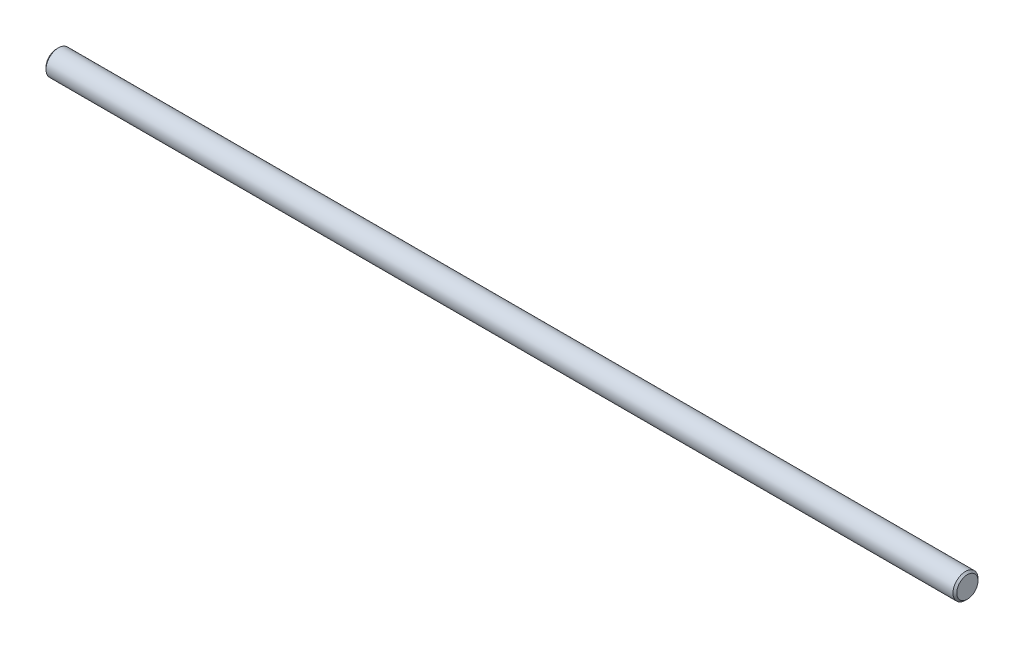
ISO-10303-21;
HEADER;
FILE_DESCRIPTION(('STEP AP214'),'2;1');
FILE_NAME('part.step','',(''),(''),'','','');
FILE_SCHEMA(('AUTOMOTIVE_DESIGN { 1 0 10303 214 1 1 1 1 }'));
ENDSEC;
DATA;
#1=APPLICATION_CONTEXT('core data for automotive mechanical design processes');
#2=APPLICATION_PROTOCOL_DEFINITION('international standard','automotive_design',2000,#1);
#3=PRODUCT_CONTEXT('',#1,'mechanical');
#4=PRODUCT('Part','Part','',(#3));
#5=PRODUCT_RELATED_PRODUCT_CATEGORY('part','',(#4));
#6=PRODUCT_DEFINITION_FORMATION('','',#4);
#7=PRODUCT_DEFINITION_CONTEXT('part definition',#1,'design');
#8=PRODUCT_DEFINITION('design','',#6,#7);
#9=PRODUCT_DEFINITION_SHAPE('','',#8);
#10=(LENGTH_UNIT() NAMED_UNIT(*) SI_UNIT(.MILLI.,.METRE.));
#11=(NAMED_UNIT(*) PLANE_ANGLE_UNIT() SI_UNIT($,.RADIAN.));
#12=(NAMED_UNIT(*) SI_UNIT($,.STERADIAN.) SOLID_ANGLE_UNIT());
#13=UNCERTAINTY_MEASURE_WITH_UNIT(LENGTH_MEASURE(1.E-05),#10,'distance_accuracy_value','');
#14=(GEOMETRIC_REPRESENTATION_CONTEXT(3) GLOBAL_UNCERTAINTY_ASSIGNED_CONTEXT((#13)) GLOBAL_UNIT_ASSIGNED_CONTEXT((#10,
#11,#12)) REPRESENTATION_CONTEXT('',''));
#15=CARTESIAN_POINT('',(0.,0.,0.));
#16=DIRECTION('',(0.,0.,1.));
#17=DIRECTION('',(1.,0.,0.));
#18=AXIS2_PLACEMENT_3D('',#15,#16,#17);
#19=CARTESIAN_POINT('',(-144.4625,0.,0.));
#20=DIRECTION('',(1.,0.,0.));
#21=DIRECTION('',(0.,0.,-1.));
#22=AXIS2_PLACEMENT_3D('',#19,#20,#21);
#23=CYLINDRICAL_SURFACE('',#22,3.96875);
#24=CARTESIAN_POINT('',(-143.8671875,0.,0.));
#25=DIRECTION('',(1.,0.,0.));
#26=DIRECTION('',(0.,0.,-1.));
#27=AXIS2_PLACEMENT_3D('',#24,#25,#26);
#28=CIRCLE('',#27,3.96875);
#29=CARTESIAN_POINT('',(-143.8671875,0.,-3.96875));
#30=VERTEX_POINT('',#29);
#31=EDGE_CURVE('E43',#30,#30,#28,.T.);
#32=ORIENTED_EDGE('',*,*,#31,.T.);
#33=EDGE_LOOP('',(#32));
#34=FACE_BOUND('',#33,.T.);
#35=CARTESIAN_POINT('',(143.8671875,0.,0.));
#36=DIRECTION('',(1.,0.,0.));
#37=DIRECTION('',(0.,0.,-1.));
#38=AXIS2_PLACEMENT_3D('',#35,#36,#37);
#39=CIRCLE('',#38,3.96875);
#40=CARTESIAN_POINT('',(143.8671875,0.,-3.96875));
#41=VERTEX_POINT('',#40);
#42=EDGE_CURVE('E47',#41,#41,#39,.F.);
#43=ORIENTED_EDGE('',*,*,#42,.T.);
#44=EDGE_LOOP('',(#43));
#45=FACE_BOUND('',#44,.T.);
#46=ADVANCED_FACE('F32',(#34,#45),#23,.T.);
#47=CARTESIAN_POINT('',(-144.4625,0.,0.));
#48=DIRECTION('',(1.,0.,0.));
#49=DIRECTION('',(0.,0.,-1.));
#50=AXIS2_PLACEMENT_3D('',#47,#48,#49);
#51=PLANE('',#50);
#52=CARTESIAN_POINT('',(-144.4625,0.,0.));
#53=DIRECTION('',(1.,0.,0.));
#54=DIRECTION('',(0.,0.,-1.));
#55=AXIS2_PLACEMENT_3D('',#52,#53,#54);
#56=CIRCLE('',#55,3.37343749999988);
#57=CARTESIAN_POINT('',(-144.4625,0.,-3.37343749999988));
#58=VERTEX_POINT('',#57);
#59=EDGE_CURVE('E39',#58,#58,#56,.F.);
#60=ORIENTED_EDGE('',*,*,#59,.T.);
#61=EDGE_LOOP('',(#60));
#62=FACE_BOUND('',#61,.T.);
#63=ADVANCED_FACE('F63',(#62),#51,.F.);
#64=CARTESIAN_POINT('',(144.4625,0.,0.));
#65=DIRECTION('',(1.,0.,0.));
#66=DIRECTION('',(0.,0.,-1.));
#67=AXIS2_PLACEMENT_3D('',#64,#65,#66);
#68=PLANE('',#67);
#69=CARTESIAN_POINT('',(144.4625,0.,0.));
#70=DIRECTION('',(1.,0.,0.));
#71=DIRECTION('',(0.,0.,-1.));
#72=AXIS2_PLACEMENT_3D('',#69,#70,#71);
#73=CIRCLE('',#72,3.37343749999997);
#74=CARTESIAN_POINT('',(144.4625,0.,-3.37343749999997));
#75=VERTEX_POINT('',#74);
#76=EDGE_CURVE('E10',#75,#75,#73,.T.);
#77=ORIENTED_EDGE('',*,*,#76,.T.);
#78=EDGE_LOOP('',(#77));
#79=FACE_BOUND('',#78,.T.);
#80=ADVANCED_FACE('F60',(#79),#68,.T.);
#81=CARTESIAN_POINT('',(-143.8671875,0.,0.));
#82=DIRECTION('',(1.,0.,0.));
#83=DIRECTION('',(0.,0.,-1.));
#84=AXIS2_PLACEMENT_3D('',#81,#82,#83);
#85=CONICAL_SURFACE('',#84,3.96875,0.785398163397454);
#86=ORIENTED_EDGE('',*,*,#59,.F.);
#87=EDGE_LOOP('',(#86));
#88=FACE_BOUND('',#87,.T.);
#89=ORIENTED_EDGE('',*,*,#31,.F.);
#90=EDGE_LOOP('',(#89));
#91=FACE_BOUND('',#90,.T.);
#92=ADVANCED_FACE('F56',(#88,#91),#85,.T.);
#93=CARTESIAN_POINT('',(144.4625,0.,0.));
#94=DIRECTION('',(-1.,0.,0.));
#95=DIRECTION('',(0.,0.,1.));
#96=AXIS2_PLACEMENT_3D('',#93,#94,#95);
#97=CONICAL_SURFACE('',#96,3.37343749999997,0.785398163397431);
#98=ORIENTED_EDGE('',*,*,#42,.F.);
#99=EDGE_LOOP('',(#98));
#100=FACE_BOUND('',#99,.T.);
#101=ORIENTED_EDGE('',*,*,#76,.F.);
#102=EDGE_LOOP('',(#101));
#103=FACE_BOUND('',#102,.T.);
#104=ADVANCED_FACE('F34',(#100,#103),#97,.T.);
#105=CLOSED_SHELL('',(#46,#63,#80,#92,#104));
#106=MANIFOLD_SOLID_BREP('B2',#105);
#107=ADVANCED_BREP_SHAPE_REPRESENTATION('',(#18,#106),#14);
#108=SHAPE_DEFINITION_REPRESENTATION(#9,#107);
ENDSEC;
END-ISO-10303-21;
